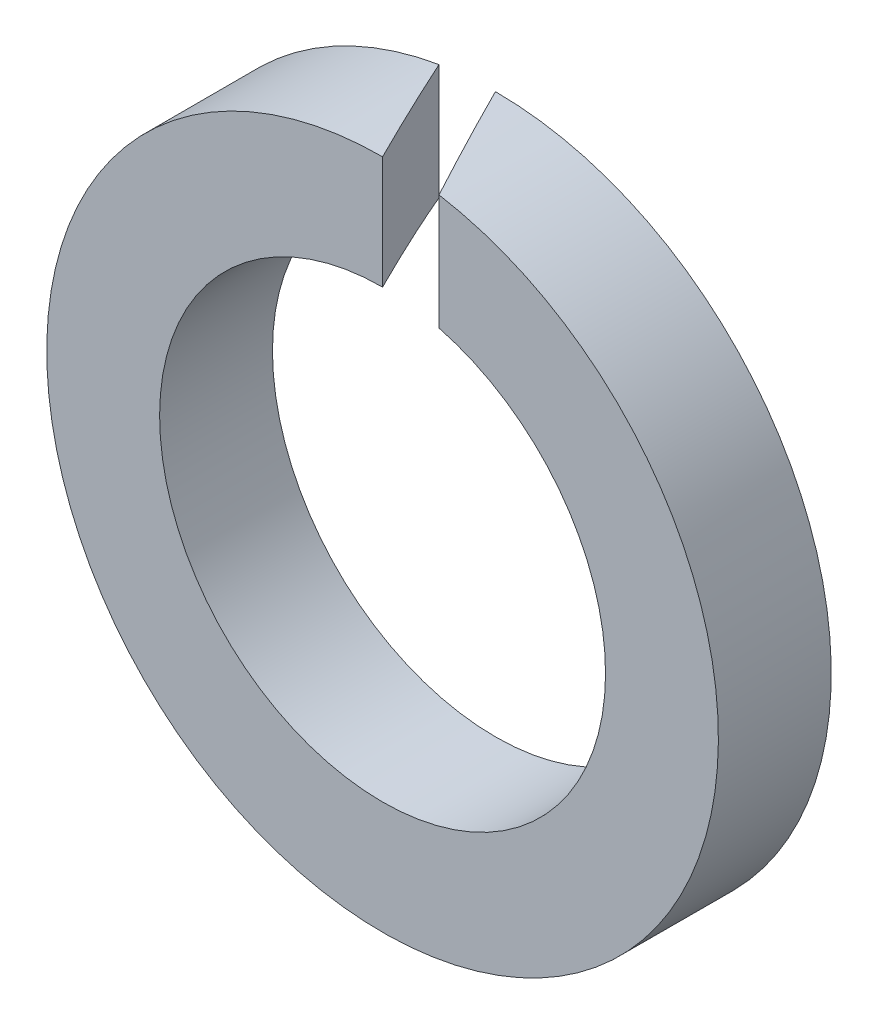
ISO-10303-21;
HEADER;
FILE_DESCRIPTION(('STEP AP214'),'2;1');
FILE_NAME('part.step','',(''),(''),'','','');
FILE_SCHEMA(('AUTOMOTIVE_DESIGN { 1 0 10303 214 1 1 1 1 }'));
ENDSEC;
DATA;
#1=APPLICATION_CONTEXT('core data for automotive mechanical design processes');
#2=APPLICATION_PROTOCOL_DEFINITION('international standard','automotive_design',2000,#1);
#3=PRODUCT_CONTEXT('',#1,'mechanical');
#4=PRODUCT('Part','Part','',(#3));
#5=PRODUCT_RELATED_PRODUCT_CATEGORY('part','',(#4));
#6=PRODUCT_DEFINITION_FORMATION('','',#4);
#7=PRODUCT_DEFINITION_CONTEXT('part definition',#1,'design');
#8=PRODUCT_DEFINITION('design','',#6,#7);
#9=PRODUCT_DEFINITION_SHAPE('','',#8);
#10=(LENGTH_UNIT() NAMED_UNIT(*) SI_UNIT(.MILLI.,.METRE.));
#11=(NAMED_UNIT(*) PLANE_ANGLE_UNIT() SI_UNIT($,.RADIAN.));
#12=(NAMED_UNIT(*) SI_UNIT($,.STERADIAN.) SOLID_ANGLE_UNIT());
#13=UNCERTAINTY_MEASURE_WITH_UNIT(LENGTH_MEASURE(1.E-05),#10,'distance_accuracy_value','');
#14=(GEOMETRIC_REPRESENTATION_CONTEXT(3) GLOBAL_UNCERTAINTY_ASSIGNED_CONTEXT((#13)) GLOBAL_UNIT_ASSIGNED_CONTEXT((#10,
#11,#12)) REPRESENTATION_CONTEXT('',''));
#15=CARTESIAN_POINT('',(0.,0.,0.));
#16=DIRECTION('',(0.,0.,1.));
#17=DIRECTION('',(1.,0.,0.));
#18=AXIS2_PLACEMENT_3D('',#15,#16,#17);
#19=CARTESIAN_POINT('',(0.,0.,4.1));
#20=DIRECTION('',(0.,0.,1.));
#21=DIRECTION('',(1.,0.,0.));
#22=AXIS2_PLACEMENT_3D('',#19,#20,#21);
#23=PLANE('',#22);
#24=CARTESIAN_POINT('',(0.,0.,4.1));
#25=DIRECTION('',(0.,0.,1.));
#26=DIRECTION('',(1.,0.,0.));
#27=AXIS2_PLACEMENT_3D('',#24,#25,#26);
#28=CIRCLE('',#27,8.1);
#29=CARTESIAN_POINT('',(2.05,7.83629376682625,4.1));
#30=VERTEX_POINT('',#29);
#31=CARTESIAN_POINT('',(0.,8.1,4.1));
#32=VERTEX_POINT('',#31);
#33=EDGE_CURVE('E67',#30,#32,#28,.F.);
#34=ORIENTED_EDGE('',*,*,#33,.T.);
#35=DIRECTION('',(0.,1.,0.));
#36=VECTOR('',#35,1.);
#37=CARTESIAN_POINT('',(0.,0.,4.1));
#38=LINE('',#37,#36);
#39=CARTESIAN_POINT('',(0.,12.2,4.1));
#40=VERTEX_POINT('',#39);
#41=EDGE_CURVE('E59',#32,#40,#38,.T.);
#42=ORIENTED_EDGE('',*,*,#41,.T.);
#43=CARTESIAN_POINT('',(0.,0.,4.1));
#44=DIRECTION('',(0.,0.,1.));
#45=DIRECTION('',(1.,0.,0.));
#46=AXIS2_PLACEMENT_3D('',#43,#44,#45);
#47=CIRCLE('',#46,12.2);
#48=CARTESIAN_POINT('',(2.05,12.0265331662953,4.1));
#49=VERTEX_POINT('',#48);
#50=EDGE_CURVE('E79',#49,#40,#47,.F.);
#51=ORIENTED_EDGE('',*,*,#50,.F.);
#52=DIRECTION('',(0.,1.,0.));
#53=VECTOR('',#52,1.);
#54=CARTESIAN_POINT('',(2.05,0.,4.1));
#55=LINE('',#54,#53);
#56=EDGE_CURVE('E72',#49,#30,#55,.F.);
#57=ORIENTED_EDGE('',*,*,#56,.T.);
#58=EDGE_LOOP('',(#34,#42,#51,#57));
#59=FACE_BOUND('',#58,.T.);
#60=ADVANCED_FACE('F17',(#59),#23,.T.);
#61=CARTESIAN_POINT('',(-2.05,0.,0.));
#62=DIRECTION('',(-0.894427190999916,0.,0.447213595499958));
#63=DIRECTION('',(0.447213595499958,0.,0.894427190999916));
#64=AXIS2_PLACEMENT_3D('',#61,#62,#63);
#65=PLANE('',#64);
#66=CARTESIAN_POINT('',(0.,0.,4.1));
#67=DIRECTION('',(-0.894427190999916,0.,0.447213595499958));
#68=DIRECTION('',(0.447213595499958,0.,0.894427190999916));
#69=AXIS2_PLACEMENT_3D('',#66,#67,#68);
#70=ELLIPSE('',#69,27.2800293254974,12.2);
#71=CARTESIAN_POINT('',(-2.05,12.0265331662953,0.));
#72=VERTEX_POINT('',#71);
#73=EDGE_CURVE('E20',#40,#72,#70,.T.);
#74=ORIENTED_EDGE('',*,*,#73,.F.);
#75=ORIENTED_EDGE('',*,*,#41,.F.);
#76=CARTESIAN_POINT('',(0.,0.,4.1));
#77=DIRECTION('',(-0.894427190999916,0.,0.447213595499958));
#78=DIRECTION('',(0.447213595499958,0.,0.894427190999916));
#79=AXIS2_PLACEMENT_3D('',#76,#77,#78);
#80=ELLIPSE('',#79,18.1121506177483,8.1);
#81=CARTESIAN_POINT('',(-2.05,7.83629376682625,0.));
#82=VERTEX_POINT('',#81);
#83=EDGE_CURVE('E62',#32,#82,#80,.T.);
#84=ORIENTED_EDGE('',*,*,#83,.T.);
#85=DIRECTION('',(0.,1.,0.));
#86=VECTOR('',#85,1.);
#87=CARTESIAN_POINT('',(-2.05,0.,0.));
#88=LINE('',#87,#86);
#89=EDGE_CURVE('E69',#82,#72,#88,.T.);
#90=ORIENTED_EDGE('',*,*,#89,.T.);
#91=EDGE_LOOP('',(#74,#75,#84,#90));
#92=FACE_BOUND('',#91,.T.);
#93=ADVANCED_FACE('F60',(#92),#65,.F.);
#94=CARTESIAN_POINT('',(0.,0.,0.));
#95=DIRECTION('',(0.,0.,1.));
#96=DIRECTION('',(1.,0.,0.));
#97=AXIS2_PLACEMENT_3D('',#94,#95,#96);
#98=CYLINDRICAL_SURFACE('',#97,12.2);
#99=CARTESIAN_POINT('',(0.,0.,0.));
#100=DIRECTION('',(0.,0.,1.));
#101=DIRECTION('',(1.,0.,0.));
#102=AXIS2_PLACEMENT_3D('',#99,#100,#101);
#103=CIRCLE('',#102,12.2);
#104=CARTESIAN_POINT('',(0.,12.2,0.));
#105=VERTEX_POINT('',#104);
#106=EDGE_CURVE('E89',#72,#105,#103,.T.);
#107=ORIENTED_EDGE('',*,*,#106,.T.);
#108=CARTESIAN_POINT('',(0.,0.,0.));
#109=DIRECTION('',(0.894427190999916,0.,-0.447213595499958));
#110=DIRECTION('',(0.447213595499958,0.,0.894427190999916));
#111=AXIS2_PLACEMENT_3D('',#108,#109,#110);
#112=ELLIPSE('',#111,27.2800293254974,12.2);
#113=EDGE_CURVE('E77',#105,#49,#112,.T.);
#114=ORIENTED_EDGE('',*,*,#113,.T.);
#115=ORIENTED_EDGE('',*,*,#50,.T.);
#116=ORIENTED_EDGE('',*,*,#73,.T.);
#117=EDGE_LOOP('',(#107,#114,#115,#116));
#118=FACE_BOUND('',#117,.T.);
#119=ADVANCED_FACE('F80',(#118),#98,.T.);
#120=CARTESIAN_POINT('',(2.05,0.,4.1));
#121=DIRECTION('',(0.894427190999916,0.,-0.447213595499958));
#122=DIRECTION('',(-0.447213595499958,0.,-0.894427190999916));
#123=AXIS2_PLACEMENT_3D('',#120,#121,#122);
#124=PLANE('',#123);
#125=CARTESIAN_POINT('',(0.,0.,0.));
#126=DIRECTION('',(0.894427190999916,0.,-0.447213595499958));
#127=DIRECTION('',(0.447213595499958,0.,0.894427190999916));
#128=AXIS2_PLACEMENT_3D('',#125,#126,#127);
#129=ELLIPSE('',#128,18.1121506177483,8.1);
#130=CARTESIAN_POINT('',(0.,8.1,0.));
#131=VERTEX_POINT('',#130);
#132=EDGE_CURVE('E34',#131,#30,#129,.T.);
#133=ORIENTED_EDGE('',*,*,#132,.T.);
#134=ORIENTED_EDGE('',*,*,#56,.F.);
#135=ORIENTED_EDGE('',*,*,#113,.F.);
#136=DIRECTION('',(0.,1.,0.));
#137=VECTOR('',#136,1.);
#138=CARTESIAN_POINT('',(0.,0.,0.));
#139=LINE('',#138,#137);
#140=EDGE_CURVE('E26',#105,#131,#139,.F.);
#141=ORIENTED_EDGE('',*,*,#140,.T.);
#142=EDGE_LOOP('',(#133,#134,#135,#141));
#143=FACE_BOUND('',#142,.T.);
#144=ADVANCED_FACE('F83',(#143),#124,.F.);
#145=CARTESIAN_POINT('',(0.,0.,0.));
#146=DIRECTION('',(0.,0.,1.));
#147=DIRECTION('',(1.,0.,0.));
#148=AXIS2_PLACEMENT_3D('',#145,#146,#147);
#149=CYLINDRICAL_SURFACE('',#148,8.1);
#150=CARTESIAN_POINT('',(0.,0.,0.));
#151=DIRECTION('',(0.,0.,1.));
#152=DIRECTION('',(1.,0.,0.));
#153=AXIS2_PLACEMENT_3D('',#150,#151,#152);
#154=CIRCLE('',#153,8.1);
#155=EDGE_CURVE('E11',#131,#82,#154,.F.);
#156=ORIENTED_EDGE('',*,*,#155,.T.);
#157=ORIENTED_EDGE('',*,*,#83,.F.);
#158=ORIENTED_EDGE('',*,*,#33,.F.);
#159=ORIENTED_EDGE('',*,*,#132,.F.);
#160=EDGE_LOOP('',(#156,#157,#158,#159));
#161=FACE_BOUND('',#160,.T.);
#162=ADVANCED_FACE('F66',(#161),#149,.F.);
#163=CARTESIAN_POINT('',(0.,0.,0.));
#164=DIRECTION('',(0.,0.,1.));
#165=DIRECTION('',(1.,0.,0.));
#166=AXIS2_PLACEMENT_3D('',#163,#164,#165);
#167=PLANE('',#166);
#168=ORIENTED_EDGE('',*,*,#155,.F.);
#169=ORIENTED_EDGE('',*,*,#140,.F.);
#170=ORIENTED_EDGE('',*,*,#106,.F.);
#171=ORIENTED_EDGE('',*,*,#89,.F.);
#172=EDGE_LOOP('',(#168,#169,#170,#171));
#173=FACE_BOUND('',#172,.T.);
#174=ADVANCED_FACE('F91',(#173),#167,.F.);
#175=CLOSED_SHELL('',(#60,#93,#119,#144,#162,#174));
#176=MANIFOLD_SOLID_BREP('B1',#175);
#177=ADVANCED_BREP_SHAPE_REPRESENTATION('',(#18,#176),#14);
#178=SHAPE_DEFINITION_REPRESENTATION(#9,#177);
ENDSEC;
END-ISO-10303-21;
